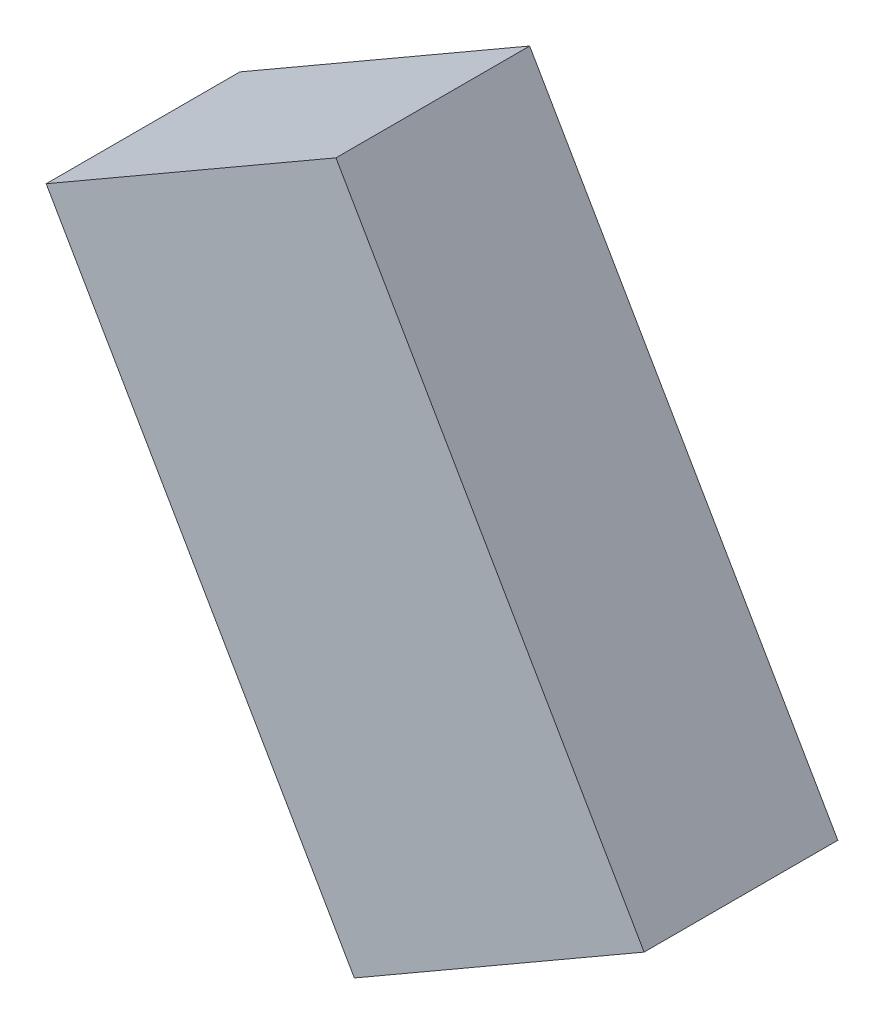
ISO-10303-21;
HEADER;
FILE_DESCRIPTION(('STEP AP214'),'2;1');
FILE_NAME('part.step','',(''),(''),'','','');
FILE_SCHEMA(('AUTOMOTIVE_DESIGN { 1 0 10303 214 1 1 1 1 }'));
ENDSEC;
DATA;
#1=APPLICATION_CONTEXT('core data for automotive mechanical design processes');
#2=APPLICATION_PROTOCOL_DEFINITION('international standard','automotive_design',2000,#1);
#3=PRODUCT_CONTEXT('',#1,'mechanical');
#4=PRODUCT('Part','Part','',(#3));
#5=PRODUCT_RELATED_PRODUCT_CATEGORY('part','',(#4));
#6=PRODUCT_DEFINITION_FORMATION('','',#4);
#7=PRODUCT_DEFINITION_CONTEXT('part definition',#1,'design');
#8=PRODUCT_DEFINITION('design','',#6,#7);
#9=PRODUCT_DEFINITION_SHAPE('','',#8);
#10=(LENGTH_UNIT() NAMED_UNIT(*) SI_UNIT(.MILLI.,.METRE.));
#11=(NAMED_UNIT(*) PLANE_ANGLE_UNIT() SI_UNIT($,.RADIAN.));
#12=(NAMED_UNIT(*) SI_UNIT($,.STERADIAN.) SOLID_ANGLE_UNIT());
#13=UNCERTAINTY_MEASURE_WITH_UNIT(LENGTH_MEASURE(1.E-05),#10,'distance_accuracy_value','');
#14=(GEOMETRIC_REPRESENTATION_CONTEXT(3) GLOBAL_UNCERTAINTY_ASSIGNED_CONTEXT((#13)) GLOBAL_UNIT_ASSIGNED_CONTEXT((#10,
#11,#12)) REPRESENTATION_CONTEXT('',''));
#15=CARTESIAN_POINT('',(0.,0.,0.));
#16=DIRECTION('',(0.,0.,1.));
#17=DIRECTION('',(1.,0.,0.));
#18=AXIS2_PLACEMENT_3D('',#15,#16,#17);
#19=CARTESIAN_POINT('',(0.84886292,-0.52027074,0.5499989));
#20=DIRECTION('',(0.,0.,-1.));
#21=DIRECTION('',(-1.,0.,0.));
#22=AXIS2_PLACEMENT_3D('',#19,#20,#21);
#23=PLANE('',#22);
#24=DIRECTION('',(0.86602583329618,0.499999256063104,0.));
#25=VECTOR('',#24,1.);
#26=CARTESIAN_POINT('',(-0.0261366,0.99527106,0.5499989));
#27=LINE('',#26,#25);
#28=CARTESIAN_POINT('',(-0.0261365999999377,0.995271060000036,0.5499989));
#29=VERTEX_POINT('',#28);
#30=CARTESIAN_POINT('',(-0.848862920000052,0.52027074000009,0.5499989));
#31=VERTEX_POINT('',#30);
#32=EDGE_CURVE('E55',#29,#31,#27,.F.);
#33=ORIENTED_EDGE('',*,*,#32,.T.);
#34=DIRECTION('',(-0.500000451629818,0.866025143035685,0.));
#35=VECTOR('',#34,1.);
#36=CARTESIAN_POINT('',(-0.84886292,0.52027074,0.5499989));
#37=LINE('',#36,#35);
#38=CARTESIAN_POINT('',(0.0261365999999377,-0.995271060000036,0.5499989));
#39=VERTEX_POINT('',#38);
#40=EDGE_CURVE('E57',#31,#39,#37,.F.);
#41=ORIENTED_EDGE('',*,*,#40,.T.);
#42=DIRECTION('',(-0.86602583329618,-0.499999256063104,0.));
#43=VECTOR('',#42,1.);
#44=CARTESIAN_POINT('',(0.0261366,-0.99527106,0.5499989));
#45=LINE('',#44,#43);
#46=CARTESIAN_POINT('',(0.848862920000104,-0.520270740000181,0.5499989));
#47=VERTEX_POINT('',#46);
#48=EDGE_CURVE('E20',#39,#47,#45,.F.);
#49=ORIENTED_EDGE('',*,*,#48,.T.);
#50=DIRECTION('',(0.500000451629818,-0.866025143035685,0.));
#51=VECTOR('',#50,1.);
#52=CARTESIAN_POINT('',(0.84886292,-0.52027074,0.5499989));
#53=LINE('',#52,#51);
#54=EDGE_CURVE('E80',#47,#29,#53,.F.);
#55=ORIENTED_EDGE('',*,*,#54,.T.);
#56=EDGE_LOOP('',(#33,#41,#49,#55));
#57=FACE_BOUND('',#56,.T.);
#58=ADVANCED_FACE('F17',(#57),#23,.F.);
#59=CARTESIAN_POINT('',(0.0261366,-0.99527106,0.));
#60=DIRECTION('',(-0.499999256063104,0.86602583329618,0.));
#61=DIRECTION('',(-0.86602583329618,-0.499999256063104,0.));
#62=AXIS2_PLACEMENT_3D('',#59,#60,#61);
#63=PLANE('',#62);
#64=DIRECTION('',(0.,0.,1.));
#65=VECTOR('',#64,1.);
#66=CARTESIAN_POINT('',(0.84886292,-0.52027074,0.));
#67=LINE('',#66,#65);
#68=CARTESIAN_POINT('',(0.848862920000104,-0.520270740000181,0.));
#69=VERTEX_POINT('',#68);
#70=EDGE_CURVE('E68',#69,#47,#67,.T.);
#71=ORIENTED_EDGE('',*,*,#70,.T.);
#72=ORIENTED_EDGE('',*,*,#48,.F.);
#73=DIRECTION('',(0.,0.,1.));
#74=VECTOR('',#73,1.);
#75=CARTESIAN_POINT('',(0.0261365999997507,-0.995271060000145,0.));
#76=LINE('',#75,#74);
#77=CARTESIAN_POINT('',(0.0261365999999377,-0.995271060000036,0.));
#78=VERTEX_POINT('',#77);
#79=EDGE_CURVE('E63',#39,#78,#76,.F.);
#80=ORIENTED_EDGE('',*,*,#79,.T.);
#81=DIRECTION('',(-0.86602583329596,-0.499999256063484,0.));
#82=VECTOR('',#81,1.);
#83=CARTESIAN_POINT('',(0.84886292,-0.52027074,0.));
#84=LINE('',#83,#82);
#85=EDGE_CURVE('E83',#69,#78,#84,.T.);
#86=ORIENTED_EDGE('',*,*,#85,.F.);
#87=EDGE_LOOP('',(#71,#72,#80,#86));
#88=FACE_BOUND('',#87,.T.);
#89=ADVANCED_FACE('F65',(#88),#63,.F.);
#90=CARTESIAN_POINT('',(-0.84886292,0.52027074,0.));
#91=DIRECTION('',(0.866025143035685,0.500000451629818,0.));
#92=DIRECTION('',(-0.500000451629818,0.866025143035685,0.));
#93=AXIS2_PLACEMENT_3D('',#90,#91,#92);
#94=PLANE('',#93);
#95=ORIENTED_EDGE('',*,*,#79,.F.);
#96=ORIENTED_EDGE('',*,*,#40,.F.);
#97=DIRECTION('',(0.,0.,1.));
#98=VECTOR('',#97,1.);
#99=CARTESIAN_POINT('',(-0.848862920000208,0.520270740000361,0.));
#100=LINE('',#99,#98);
#101=CARTESIAN_POINT('',(-0.848862920000052,0.52027074000009,0.));
#102=VERTEX_POINT('',#101);
#103=EDGE_CURVE('E75',#31,#102,#100,.F.);
#104=ORIENTED_EDGE('',*,*,#103,.T.);
#105=DIRECTION('',(-0.500000451629961,0.866025143035602,0.));
#106=VECTOR('',#105,1.);
#107=CARTESIAN_POINT('',(0.0261366000000001,-0.99527106,0.));
#108=LINE('',#107,#106);
#109=EDGE_CURVE('E72',#78,#102,#108,.T.);
#110=ORIENTED_EDGE('',*,*,#109,.F.);
#111=EDGE_LOOP('',(#95,#96,#104,#110));
#112=FACE_BOUND('',#111,.T.);
#113=ADVANCED_FACE('F70',(#112),#94,.F.);
#114=CARTESIAN_POINT('',(-0.0261366,0.99527106,0.));
#115=DIRECTION('',(0.499999256063104,-0.86602583329618,0.));
#116=DIRECTION('',(0.86602583329618,0.499999256063104,0.));
#117=AXIS2_PLACEMENT_3D('',#114,#115,#116);
#118=PLANE('',#117);
#119=ORIENTED_EDGE('',*,*,#103,.F.);
#120=ORIENTED_EDGE('',*,*,#32,.F.);
#121=DIRECTION('',(0.,0.,1.));
#122=VECTOR('',#121,1.);
#123=CARTESIAN_POINT('',(-0.0261365999997507,0.995271060000145,0.));
#124=LINE('',#123,#122);
#125=CARTESIAN_POINT('',(-0.0261365999999377,0.995271060000036,0.));
#126=VERTEX_POINT('',#125);
#127=EDGE_CURVE('E35',#29,#126,#124,.F.);
#128=ORIENTED_EDGE('',*,*,#127,.T.);
#129=DIRECTION('',(0.86602583329596,0.499999256063484,0.));
#130=VECTOR('',#129,1.);
#131=CARTESIAN_POINT('',(-0.84886292,0.52027074,0.));
#132=LINE('',#131,#130);
#133=EDGE_CURVE('E26',#102,#126,#132,.T.);
#134=ORIENTED_EDGE('',*,*,#133,.F.);
#135=EDGE_LOOP('',(#119,#120,#128,#134));
#136=FACE_BOUND('',#135,.T.);
#137=ADVANCED_FACE('F89',(#136),#118,.F.);
#138=CARTESIAN_POINT('',(0.84886292,-0.52027074,0.));
#139=DIRECTION('',(-0.866025143035685,-0.500000451629818,0.));
#140=DIRECTION('',(0.500000451629818,-0.866025143035685,0.));
#141=AXIS2_PLACEMENT_3D('',#138,#139,#140);
#142=PLANE('',#141);
#143=ORIENTED_EDGE('',*,*,#127,.F.);
#144=ORIENTED_EDGE('',*,*,#54,.F.);
#145=ORIENTED_EDGE('',*,*,#70,.F.);
#146=DIRECTION('',(0.500000451629961,-0.866025143035602,0.));
#147=VECTOR('',#146,1.);
#148=CARTESIAN_POINT('',(-0.0261366000000001,0.99527106,0.));
#149=LINE('',#148,#147);
#150=EDGE_CURVE('E11',#126,#69,#149,.T.);
#151=ORIENTED_EDGE('',*,*,#150,.F.);
#152=EDGE_LOOP('',(#143,#144,#145,#151));
#153=FACE_BOUND('',#152,.T.);
#154=ADVANCED_FACE('F91',(#153),#142,.F.);
#155=CARTESIAN_POINT('',(0.84886292,-0.52027074,0.));
#156=DIRECTION('',(0.,0.,-1.));
#157=DIRECTION('',(-1.,0.,0.));
#158=AXIS2_PLACEMENT_3D('',#155,#156,#157);
#159=PLANE('',#158);
#160=ORIENTED_EDGE('',*,*,#133,.T.);
#161=ORIENTED_EDGE('',*,*,#150,.T.);
#162=ORIENTED_EDGE('',*,*,#85,.T.);
#163=ORIENTED_EDGE('',*,*,#109,.T.);
#164=EDGE_LOOP('',(#160,#161,#162,#163));
#165=FACE_BOUND('',#164,.T.);
#166=ADVANCED_FACE('F88',(#165),#159,.T.);
#167=CLOSED_SHELL('',(#58,#89,#113,#137,#154,#166));
#168=MANIFOLD_SOLID_BREP('B1',#167);
#169=ADVANCED_BREP_SHAPE_REPRESENTATION('',(#18,#168),#14);
#170=SHAPE_DEFINITION_REPRESENTATION(#9,#169);
ENDSEC;
END-ISO-10303-21;
